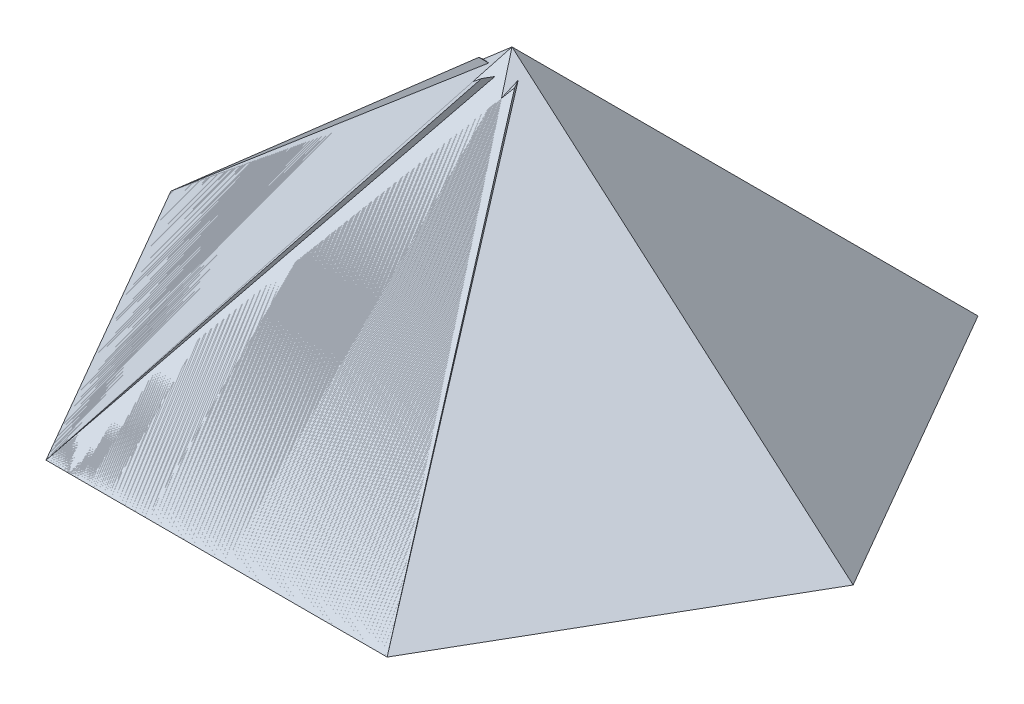
ISO-10303-21;
HEADER;
FILE_DESCRIPTION(('STEP AP214'),'2;1');
FILE_NAME('part.step','',(''),(''),'','','');
FILE_SCHEMA(('AUTOMOTIVE_DESIGN { 1 0 10303 214 1 1 1 1 }'));
ENDSEC;
DATA;
#1=APPLICATION_CONTEXT('core data for automotive mechanical design processes');
#2=APPLICATION_PROTOCOL_DEFINITION('international standard','automotive_design',2000,#1);
#3=PRODUCT_CONTEXT('',#1,'mechanical');
#4=PRODUCT('Part','Part','',(#3));
#5=PRODUCT_RELATED_PRODUCT_CATEGORY('part','',(#4));
#6=PRODUCT_DEFINITION_FORMATION('','',#4);
#7=PRODUCT_DEFINITION_CONTEXT('part definition',#1,'design');
#8=PRODUCT_DEFINITION('design','',#6,#7);
#9=PRODUCT_DEFINITION_SHAPE('','',#8);
#10=(LENGTH_UNIT() NAMED_UNIT(*) SI_UNIT(.MILLI.,.METRE.));
#11=(NAMED_UNIT(*) PLANE_ANGLE_UNIT() SI_UNIT($,.RADIAN.));
#12=(NAMED_UNIT(*) SI_UNIT($,.STERADIAN.) SOLID_ANGLE_UNIT());
#13=UNCERTAINTY_MEASURE_WITH_UNIT(LENGTH_MEASURE(1.E-05),#10,'distance_accuracy_value','');
#14=(GEOMETRIC_REPRESENTATION_CONTEXT(3) GLOBAL_UNCERTAINTY_ASSIGNED_CONTEXT((#13)) GLOBAL_UNIT_ASSIGNED_CONTEXT((#10,
#11,#12)) REPRESENTATION_CONTEXT('',''));
#15=CARTESIAN_POINT('',(0.,0.,0.));
#16=DIRECTION('',(0.,0.,1.));
#17=DIRECTION('',(1.,0.,0.));
#18=AXIS2_PLACEMENT_3D('',#15,#16,#17);
#19=CARTESIAN_POINT('',(-5.60315682740509E-13,24.3213065701559,24.3213065701559));
#20=DIRECTION('',(0.,-0.707106781186548,-0.707106781186547));
#21=DIRECTION('',(-0.377964473009212,0.654653670707977,-0.654653670707986));
#22=AXIS2_PLACEMENT_3D('',#19,#20,#21);
#23=PLANE('',#22);
#24=DIRECTION('',(-1.,0.,0.));
#25=VECTOR('',#24,1.);
#26=CARTESIAN_POINT('',(28.0838257906447,0.,48.6426131403125));
#27=LINE('',#26,#25);
#28=CARTESIAN_POINT('',(28.0838257906447,0.,48.6426131403125));
#29=VERTEX_POINT('',#28);
#30=CARTESIAN_POINT('',(-35.4161742093552,0.,48.642613140311));
#31=VERTEX_POINT('',#30);
#32=EDGE_CURVE('E93',#29,#31,#27,.T.);
#33=ORIENTED_EDGE('',*,*,#32,.T.);
#34=DIRECTION('',(0.435138197754014,0.636653260753214,-0.636653260753205));
#35=VECTOR('',#34,1.);
#36=CARTESIAN_POINT('',(0.,51.8176131403117,-3.17499999999998));
#37=LINE('',#36,#35);
#38=CARTESIAN_POINT('',(0.,51.8176131403117,-3.17499999999998));
#39=VERTEX_POINT('',#38);
#40=EDGE_CURVE('E89',#31,#39,#37,.T.);
#41=ORIENTED_EDGE('',*,*,#40,.T.);
#42=DIRECTION('',(0.357855020941318,-0.660280161744648,0.660280161744657));
#43=VECTOR('',#42,1.);
#44=CARTESIAN_POINT('',(28.0838257906447,0.,48.6426131403125));
#45=LINE('',#44,#43);
#46=EDGE_CURVE('E85',#39,#29,#45,.T.);
#47=ORIENTED_EDGE('',*,*,#46,.T.);
#48=EDGE_LOOP('',(#33,#41,#47));
#49=FACE_BOUND('',#48,.T.);
#50=ADVANCED_FACE('F52',(#49),#23,.T.);
#51=CARTESIAN_POINT('',(3.66617420935338,24.3213065701559,30.671306570156));
#52=DIRECTION('',(0.,-0.707106781186548,-0.707106781186547));
#53=DIRECTION('',(-0.377964473009212,0.654653670707977,-0.654653670707986));
#54=AXIS2_PLACEMENT_3D('',#51,#52,#53);
#55=PLANE('',#54);
#56=DIRECTION('',(-1.,0.,0.));
#57=VECTOR('',#56,1.);
#58=CARTESIAN_POINT('',(31.7499999999987,0.,54.9926131403126));
#59=LINE('',#58,#57);
#60=CARTESIAN_POINT('',(31.7499999999987,0.,54.9926131403126));
#61=VERTEX_POINT('',#60);
#62=CARTESIAN_POINT('',(-31.7500000000013,0.,54.9926131403111));
#63=VERTEX_POINT('',#62);
#64=EDGE_CURVE('E75',#61,#63,#59,.T.);
#65=ORIENTED_EDGE('',*,*,#64,.F.);
#66=DIRECTION('',(0.357855020941318,-0.660280161744648,0.660280161744657));
#67=VECTOR('',#66,1.);
#68=CARTESIAN_POINT('',(31.7499999999987,0.,54.9926131403126));
#69=LINE('',#68,#67);
#70=CARTESIAN_POINT('',(3.66617420935402,51.8176131403117,3.17500000000011));
#71=VERTEX_POINT('',#70);
#72=EDGE_CURVE('E12',#71,#61,#69,.T.);
#73=ORIENTED_EDGE('',*,*,#72,.F.);
#74=DIRECTION('',(0.435138197754014,0.636653260753214,-0.636653260753205));
#75=VECTOR('',#74,1.);
#76=CARTESIAN_POINT('',(3.66617420935402,51.8176131403117,3.17500000000011));
#77=LINE('',#76,#75);
#78=EDGE_CURVE('E66',#63,#71,#77,.T.);
#79=ORIENTED_EDGE('',*,*,#78,.F.);
#80=EDGE_LOOP('',(#65,#73,#79));
#81=FACE_BOUND('',#80,.T.);
#82=ADVANCED_FACE('F114',(#81),#55,.F.);
#83=CARTESIAN_POINT('',(28.0838257906447,0.,48.6426131403125));
#84=DIRECTION('',(0.,1.,0.));
#85=DIRECTION('',(0.86602540378445,0.,-0.49999999999998));
#86=AXIS2_PLACEMENT_3D('',#83,#84,#85);
#87=PLANE('',#86);
#88=DIRECTION('',(0.499999999999977,0.,0.866025403784452));
#89=VECTOR('',#88,1.);
#90=CARTESIAN_POINT('',(-35.4161742093552,0.,48.642613140311));
#91=LINE('',#90,#89);
#92=EDGE_CURVE('E96',#31,#63,#91,.T.);
#93=ORIENTED_EDGE('',*,*,#92,.F.);
#94=ORIENTED_EDGE('',*,*,#32,.F.);
#95=DIRECTION('',(0.499999999999977,0.,0.866025403784452));
#96=VECTOR('',#95,1.);
#97=CARTESIAN_POINT('',(28.0838257906447,0.,48.6426131403125));
#98=LINE('',#97,#96);
#99=EDGE_CURVE('E95',#29,#61,#98,.T.);
#100=ORIENTED_EDGE('',*,*,#99,.T.);
#101=ORIENTED_EDGE('',*,*,#64,.T.);
#102=EDGE_LOOP('',(#93,#94,#100,#101));
#103=FACE_BOUND('',#102,.T.);
#104=ADVANCED_FACE('F94',(#103),#87,.F.);
#105=CARTESIAN_POINT('',(0.,51.8176131403117,-3.17499999999998));
#106=DIRECTION('',(0.58490333989433,-0.737462390435805,-0.337694100737881));
#107=DIRECTION('',(-0.638661164453014,-0.675388201475794,0.368731195217888));
#108=AXIS2_PLACEMENT_3D('',#105,#106,#107);
#109=PLANE('',#108);
#110=DIRECTION('',(0.499999999999977,0.,0.866025403784452));
#111=VECTOR('',#110,1.);
#112=CARTESIAN_POINT('',(0.,51.8176131403117,-3.17499999999998));
#113=LINE('',#112,#111);
#114=EDGE_CURVE('E59',#39,#71,#113,.T.);
#115=ORIENTED_EDGE('',*,*,#114,.F.);
#116=ORIENTED_EDGE('',*,*,#40,.F.);
#117=ORIENTED_EDGE('',*,*,#92,.T.);
#118=ORIENTED_EDGE('',*,*,#78,.T.);
#119=EDGE_LOOP('',(#115,#116,#117,#118));
#120=FACE_BOUND('',#119,.T.);
#121=ADVANCED_FACE('F106',(#120),#109,.F.);
#122=CARTESIAN_POINT('',(28.0838257906447,0.,48.6426131403125));
#123=DIRECTION('',(-0.865619271316062,0.0306219338878571,0.499765519310025));
#124=DIRECTION('',(0.0265193726598922,0.999531038620096,-0.0153109669439279));
#125=AXIS2_PLACEMENT_3D('',#122,#123,#124);
#126=PLANE('',#125);
#127=ORIENTED_EDGE('',*,*,#72,.T.);
#128=ORIENTED_EDGE('',*,*,#99,.F.);
#129=ORIENTED_EDGE('',*,*,#46,.F.);
#130=ORIENTED_EDGE('',*,*,#114,.T.);
#131=EDGE_LOOP('',(#127,#128,#129,#130));
#132=FACE_BOUND('',#131,.T.);
#133=ADVANCED_FACE('F99',(#132),#126,.F.);
#134=CLOSED_SHELL('',(#50,#82,#104,#121,#133));
#135=MANIFOLD_SOLID_BREP('B2',#134);
#136=CARTESIAN_POINT('',(-21.0628693429845,24.3213065701559,12.1606532850777));
#137=DIRECTION('',(0.612372435695798,-0.707106781186548,-0.353553390593267));
#138=DIRECTION('',(0.377964473009235,0.654653670707977,-0.654653670707973));
#139=AXIS2_PLACEMENT_3D('',#136,#137,#138);
#140=PLANE('',#139);
#141=DIRECTION('',(-0.49999999999999,0.,-0.866025403784444));
#142=VECTOR('',#141,1.);
#143=CARTESIAN_POINT('',(-28.0838257906464,0.,48.6426131403115));
#144=LINE('',#143,#142);
#145=CARTESIAN_POINT('',(-28.0838257906464,0.,48.6426131403115));
#146=VERTEX_POINT('',#145);
#147=CARTESIAN_POINT('',(-59.8338257906458,0.,-6.3500000000007));
#148=VERTEX_POINT('',#147);
#149=EDGE_CURVE('E201',#146,#148,#144,.T.);
#150=ORIENTED_EDGE('',*,*,#149,.T.);
#151=DIRECTION('',(0.768926996091482,0.636653260753214,0.0585141030353414));
#152=VECTOR('',#151,1.);
#153=CARTESIAN_POINT('',(2.74963065701559,51.8176131403117,-1.58749999999995));
#154=LINE('',#153,#152);
#155=CARTESIAN_POINT('',(2.74963065701559,51.8176131403117,-1.58749999999995));
#156=VERTEX_POINT('',#155);
#157=EDGE_CURVE('E197',#148,#156,#154,.T.);
#158=ORIENTED_EDGE('',*,*,#157,.T.);
#159=DIRECTION('',(-0.392891883215105,-0.660280161744648,0.640051619879326));
#160=VECTOR('',#159,1.);
#161=CARTESIAN_POINT('',(-28.0838257906464,0.,48.6426131403115));
#162=LINE('',#161,#160);
#163=EDGE_CURVE('E193',#156,#146,#162,.T.);
#164=ORIENTED_EDGE('',*,*,#163,.T.);
#165=EDGE_LOOP('',(#150,#158,#164));
#166=FACE_BOUND('',#165,.T.);
#167=ADVANCED_FACE('F160',(#166),#140,.T.);
#168=CARTESIAN_POINT('',(-24.7290435523387,24.3213065701559,18.5106532850776));
#169=DIRECTION('',(0.612372435695798,-0.707106781186548,-0.353553390593267));
#170=DIRECTION('',(0.377964473009235,0.654653670707977,-0.654653670707973));
#171=AXIS2_PLACEMENT_3D('',#168,#169,#170);
#172=PLANE('',#171);
#173=DIRECTION('',(-0.49999999999999,0.,-0.866025403784444));
#174=VECTOR('',#173,1.);
#175=CARTESIAN_POINT('',(-31.7500000000006,0.,54.9926131403114));
#176=LINE('',#175,#174);
#177=CARTESIAN_POINT('',(-31.7500000000006,0.,54.9926131403114));
#178=VERTEX_POINT('',#177);
#179=CARTESIAN_POINT('',(-63.5,0.,-7.70217223333702E-13));
#180=VERTEX_POINT('',#179);
#181=EDGE_CURVE('E183',#178,#180,#176,.T.);
#182=ORIENTED_EDGE('',*,*,#181,.F.);
#183=DIRECTION('',(-0.392891883215105,-0.660280161744648,0.640051619879326));
#184=VECTOR('',#183,1.);
#185=CARTESIAN_POINT('',(-31.7500000000006,0.,54.9926131403114));
#186=LINE('',#185,#184);
#187=CARTESIAN_POINT('',(-0.916543552338619,51.8176131403117,4.76249999999998));
#188=VERTEX_POINT('',#187);
#189=EDGE_CURVE('E50',#188,#178,#186,.T.);
#190=ORIENTED_EDGE('',*,*,#189,.F.);
#191=DIRECTION('',(0.768926996091482,0.636653260753214,0.0585141030353414));
#192=VECTOR('',#191,1.);
#193=CARTESIAN_POINT('',(-0.916543552338619,51.8176131403117,4.76249999999998));
#194=LINE('',#193,#192);
#195=EDGE_CURVE('E174',#180,#188,#194,.T.);
#196=ORIENTED_EDGE('',*,*,#195,.F.);
#197=EDGE_LOOP('',(#182,#190,#196));
#198=FACE_BOUND('',#197,.T.);
#199=ADVANCED_FACE('F222',(#198),#172,.F.);
#200=CARTESIAN_POINT('',(-28.0838257906464,0.,48.6426131403115));
#201=DIRECTION('',(0.,1.,0.));
#202=DIRECTION('',(0.866025403784433,0.,0.50000000000001));
#203=AXIS2_PLACEMENT_3D('',#200,#201,#202);
#204=PLANE('',#203);
#205=DIRECTION('',(-0.500000000000013,0.,0.866025403784431));
#206=VECTOR('',#205,1.);
#207=CARTESIAN_POINT('',(-59.8338257906458,0.,-6.3500000000007));
#208=LINE('',#207,#206);
#209=EDGE_CURVE('E204',#148,#180,#208,.T.);
#210=ORIENTED_EDGE('',*,*,#209,.F.);
#211=ORIENTED_EDGE('',*,*,#149,.F.);
#212=DIRECTION('',(-0.500000000000013,0.,0.866025403784431));
#213=VECTOR('',#212,1.);
#214=CARTESIAN_POINT('',(-28.0838257906464,0.,48.6426131403115));
#215=LINE('',#214,#213);
#216=EDGE_CURVE('E203',#146,#178,#215,.T.);
#217=ORIENTED_EDGE('',*,*,#216,.T.);
#218=ORIENTED_EDGE('',*,*,#181,.T.);
#219=EDGE_LOOP('',(#210,#211,#217,#218));
#220=FACE_BOUND('',#219,.T.);
#221=ADVANCED_FACE('F202',(#220),#204,.F.);
#222=CARTESIAN_POINT('',(2.74963065701559,51.8176131403117,-1.58749999999995));
#223=DIRECTION('',(0.584903339894315,-0.737462390435805,0.337694100737906));
#224=DIRECTION('',(-0.638661164453001,-0.675388201475794,-0.36873119521791));
#225=AXIS2_PLACEMENT_3D('',#222,#223,#224);
#226=PLANE('',#225);
#227=DIRECTION('',(-0.500000000000013,0.,0.866025403784431));
#228=VECTOR('',#227,1.);
#229=CARTESIAN_POINT('',(2.74963065701559,51.8176131403117,-1.58749999999995));
#230=LINE('',#229,#228);
#231=EDGE_CURVE('E167',#156,#188,#230,.T.);
#232=ORIENTED_EDGE('',*,*,#231,.F.);
#233=ORIENTED_EDGE('',*,*,#157,.F.);
#234=ORIENTED_EDGE('',*,*,#209,.T.);
#235=ORIENTED_EDGE('',*,*,#195,.T.);
#236=EDGE_LOOP('',(#232,#233,#234,#235));
#237=FACE_BOUND('',#236,.T.);
#238=ADVANCED_FACE('F214',(#237),#226,.F.);
#239=CARTESIAN_POINT('',(-28.0838257906464,0.,48.6426131403115));
#240=DIRECTION('',(-0.86561927131604,0.0306219338878571,-0.499765519310061));
#241=DIRECTION('',(0.0265193726598917,0.999531038620096,0.0153109669439289));
#242=AXIS2_PLACEMENT_3D('',#239,#240,#241);
#243=PLANE('',#242);
#244=ORIENTED_EDGE('',*,*,#189,.T.);
#245=ORIENTED_EDGE('',*,*,#216,.F.);
#246=ORIENTED_EDGE('',*,*,#163,.F.);
#247=ORIENTED_EDGE('',*,*,#231,.T.);
#248=EDGE_LOOP('',(#244,#245,#246,#247));
#249=FACE_BOUND('',#248,.T.);
#250=ADVANCED_FACE('F207',(#249),#243,.F.);
#251=CLOSED_SHELL('',(#167,#199,#221,#238,#250));
#252=MANIFOLD_SOLID_BREP('B6',#251);
#253=CARTESIAN_POINT('',(-21.0628693429844,24.3213065701559,-12.1606532850779));
#254=DIRECTION('',(0.612372435695794,-0.707106781186548,0.353553390593274));
#255=DIRECTION('',(0.755928946018455,0.654653670707977,0.));
#256=AXIS2_PLACEMENT_3D('',#253,#254,#255);
#257=PLANE('',#256);
#258=DIRECTION('',(0.5,0.,-0.866025403784439));
#259=VECTOR('',#258,1.);
#260=CARTESIAN_POINT('',(-56.1676515812917,0.,0.));
#261=LINE('',#260,#259);
#262=CARTESIAN_POINT('',(-56.1676515812917,0.,0.));
#263=VERTEX_POINT('',#262);
#264=CARTESIAN_POINT('',(-24.4176515812917,0.,-54.9926131403118));
#265=VERTEX_POINT('',#264);
#266=EDGE_CURVE('E309',#263,#265,#261,.T.);
#267=ORIENTED_EDGE('',*,*,#266,.T.);
#268=DIRECTION('',(0.333788798337483,0.636653260753214,0.695167363788547));
#269=VECTOR('',#268,1.);
#270=CARTESIAN_POINT('',(2.74963065701557,51.8176131403117,1.58749999999999));
#271=LINE('',#270,#269);
#272=CARTESIAN_POINT('',(2.74963065701557,51.8176131403117,1.58749999999999));
#273=VERTEX_POINT('',#272);
#274=EDGE_CURVE('E305',#265,#273,#271,.T.);
#275=ORIENTED_EDGE('',*,*,#274,.T.);
#276=DIRECTION('',(-0.75074690415643,-0.660280161744648,-0.0202285418653177));
#277=VECTOR('',#276,1.);
#278=CARTESIAN_POINT('',(-56.1676515812917,0.,0.));
#279=LINE('',#278,#277);
#280=EDGE_CURVE('E301',#273,#263,#279,.T.);
#281=ORIENTED_EDGE('',*,*,#280,.T.);
#282=EDGE_LOOP('',(#267,#275,#281));
#283=FACE_BOUND('',#282,.T.);
#284=ADVANCED_FACE('F267',(#283),#257,.T.);
#285=CARTESIAN_POINT('',(-28.3952177616926,24.3213065701559,-12.160653285078));
#286=DIRECTION('',(0.612372435695794,-0.707106781186548,0.353553390593274));
#287=DIRECTION('',(0.755928946018455,0.654653670707977,0.));
#288=AXIS2_PLACEMENT_3D('',#285,#286,#287);
#289=PLANE('',#288);
#290=DIRECTION('',(0.5,0.,-0.866025403784439));
#291=VECTOR('',#290,1.);
#292=CARTESIAN_POINT('',(-63.4999999999999,0.,0.));
#293=LINE('',#292,#291);
#294=CARTESIAN_POINT('',(-63.4999999999999,0.,0.));
#295=VERTEX_POINT('',#294);
#296=CARTESIAN_POINT('',(-31.75,0.,-54.9926131403119));
#297=VERTEX_POINT('',#296);
#298=EDGE_CURVE('E291',#295,#297,#293,.T.);
#299=ORIENTED_EDGE('',*,*,#298,.F.);
#300=DIRECTION('',(-0.75074690415643,-0.660280161744648,-0.0202285418653177));
#301=VECTOR('',#300,1.);
#302=CARTESIAN_POINT('',(-63.4999999999999,0.,0.));
#303=LINE('',#302,#301);
#304=CARTESIAN_POINT('',(-4.58271776169266,51.8176131403117,1.58749999999997));
#305=VERTEX_POINT('',#304);
#306=EDGE_CURVE('E158',#305,#295,#303,.T.);
#307=ORIENTED_EDGE('',*,*,#306,.F.);
#308=DIRECTION('',(0.333788798337483,0.636653260753214,0.695167363788547));
#309=VECTOR('',#308,1.);
#310=CARTESIAN_POINT('',(-4.58271776169266,51.8176131403117,1.58749999999997));
#311=LINE('',#310,#309);
#312=EDGE_CURVE('E282',#297,#305,#311,.T.);
#313=ORIENTED_EDGE('',*,*,#312,.F.);
#314=EDGE_LOOP('',(#299,#307,#313));
#315=FACE_BOUND('',#314,.T.);
#316=ADVANCED_FACE('F337',(#315),#289,.F.);
#317=CARTESIAN_POINT('',(-56.1676515812917,0.,0.));
#318=DIRECTION('',(0.,1.,0.));
#319=DIRECTION('',(0.,0.,1.));
#320=AXIS2_PLACEMENT_3D('',#317,#318,#319);
#321=PLANE('',#320);
#322=DIRECTION('',(-1.,0.,0.));
#323=VECTOR('',#322,1.);
#324=CARTESIAN_POINT('',(-24.4176515812917,0.,-54.9926131403118));
#325=LINE('',#324,#323);
#326=EDGE_CURVE('E312',#265,#297,#325,.T.);
#327=ORIENTED_EDGE('',*,*,#326,.F.);
#328=ORIENTED_EDGE('',*,*,#266,.F.);
#329=DIRECTION('',(-1.,0.,0.));
#330=VECTOR('',#329,1.);
#331=CARTESIAN_POINT('',(-56.1676515812917,0.,0.));
#332=LINE('',#331,#330);
#333=EDGE_CURVE('E311',#263,#295,#332,.T.);
#334=ORIENTED_EDGE('',*,*,#333,.T.);
#335=ORIENTED_EDGE('',*,*,#298,.T.);
#336=EDGE_LOOP('',(#327,#328,#334,#335));
#337=FACE_BOUND('',#336,.T.);
#338=ADVANCED_FACE('F310',(#337),#321,.F.);
#339=CARTESIAN_POINT('',(2.74963065701557,51.8176131403117,1.58749999999999));
#340=DIRECTION('',(0.,-0.737462390435805,0.675388201475794));
#341=DIRECTION('',(0.,-0.675388201475794,-0.737462390435805));
#342=AXIS2_PLACEMENT_3D('',#339,#340,#341);
#343=PLANE('',#342);
#344=DIRECTION('',(-1.,0.,0.));
#345=VECTOR('',#344,1.);
#346=CARTESIAN_POINT('',(2.74963065701557,51.8176131403117,1.58749999999999));
#347=LINE('',#346,#345);
#348=EDGE_CURVE('E275',#273,#305,#347,.T.);
#349=ORIENTED_EDGE('',*,*,#348,.F.);
#350=ORIENTED_EDGE('',*,*,#274,.F.);
#351=ORIENTED_EDGE('',*,*,#326,.T.);
#352=ORIENTED_EDGE('',*,*,#312,.T.);
#353=EDGE_LOOP('',(#349,#350,#351,#352));
#354=FACE_BOUND('',#353,.T.);
#355=ADVANCED_FACE('F329',(#354),#343,.F.);
#356=CARTESIAN_POINT('',(-56.1676515812917,0.,0.));
#357=DIRECTION('',(0.,0.0306219338878571,-0.999531038620096));
#358=DIRECTION('',(0.,0.999531038620096,0.0306219338878571));
#359=AXIS2_PLACEMENT_3D('',#356,#357,#358);
#360=PLANE('',#359);
#361=ORIENTED_EDGE('',*,*,#306,.T.);
#362=ORIENTED_EDGE('',*,*,#333,.F.);
#363=ORIENTED_EDGE('',*,*,#280,.F.);
#364=ORIENTED_EDGE('',*,*,#348,.T.);
#365=EDGE_LOOP('',(#361,#362,#363,#364));
#366=FACE_BOUND('',#365,.T.);
#367=ADVANCED_FACE('F317',(#366),#360,.F.);
#368=CLOSED_SHELL('',(#284,#316,#338,#355,#367));
#369=MANIFOLD_SOLID_BREP('B44',#368);
#370=CARTESIAN_POINT('',(0.,0.,0.));
#371=DIRECTION('',(0.,1.,0.));
#372=DIRECTION('',(0.,0.,1.));
#373=AXIS2_PLACEMENT_3D('',#370,#371,#372);
#374=PLANE('',#373);
#375=DIRECTION('',(-1.,0.,0.));
#376=VECTOR('',#375,1.);
#377=CARTESIAN_POINT('',(31.75,0.,-54.9926131403118));
#378=LINE('',#377,#376);
#379=CARTESIAN_POINT('',(31.75,0.,-54.9926131403118));
#380=VERTEX_POINT('',#379);
#381=CARTESIAN_POINT('',(-31.75,0.,-54.9926131403118));
#382=VERTEX_POINT('',#381);
#383=EDGE_CURVE('E465',#380,#382,#378,.T.);
#384=ORIENTED_EDGE('',*,*,#383,.F.);
#385=DIRECTION('',(-0.5,0.,-0.866025403784439));
#386=VECTOR('',#385,1.);
#387=CARTESIAN_POINT('',(63.5,0.,0.));
#388=LINE('',#387,#386);
#389=CARTESIAN_POINT('',(63.5,0.,0.));
#390=VERTEX_POINT('',#389);
#391=EDGE_CURVE('E485',#390,#380,#388,.T.);
#392=ORIENTED_EDGE('',*,*,#391,.F.);
#393=DIRECTION('',(0.5,0.,-0.866025403784439));
#394=VECTOR('',#393,1.);
#395=CARTESIAN_POINT('',(31.75,0.,54.9926131403118));
#396=LINE('',#395,#394);
#397=CARTESIAN_POINT('',(31.75,0.,54.9926131403118));
#398=VERTEX_POINT('',#397);
#399=EDGE_CURVE('E482',#398,#390,#396,.T.);
#400=ORIENTED_EDGE('',*,*,#399,.F.);
#401=DIRECTION('',(1.,0.,0.));
#402=VECTOR('',#401,1.);
#403=CARTESIAN_POINT('',(-31.75,0.,54.9926131403118));
#404=LINE('',#403,#402);
#405=CARTESIAN_POINT('',(-31.75,0.,54.9926131403118));
#406=VERTEX_POINT('',#405);
#407=EDGE_CURVE('E479',#406,#398,#404,.T.);
#408=ORIENTED_EDGE('',*,*,#407,.F.);
#409=DIRECTION('',(0.5,0.,0.866025403784439));
#410=VECTOR('',#409,1.);
#411=CARTESIAN_POINT('',(-63.5,0.,0.));
#412=LINE('',#411,#410);
#413=CARTESIAN_POINT('',(-63.5,0.,0.));
#414=VERTEX_POINT('',#413);
#415=EDGE_CURVE('E476',#414,#406,#412,.T.);
#416=ORIENTED_EDGE('',*,*,#415,.F.);
#417=DIRECTION('',(-0.5,0.,0.866025403784439));
#418=VECTOR('',#417,1.);
#419=CARTESIAN_POINT('',(-31.75,0.,-54.9926131403118));
#420=LINE('',#419,#418);
#421=EDGE_CURVE('E474',#382,#414,#420,.T.);
#422=ORIENTED_EDGE('',*,*,#421,.F.);
#423=EDGE_LOOP('',(#384,#392,#400,#408,#416,#422));
#424=FACE_BOUND('',#423,.T.);
#425=DIRECTION('',(-0.5,0.,0.866025403784439));
#426=VECTOR('',#425,1.);
#427=CARTESIAN_POINT('',(-42.1257386859688,0.,-24.3213065701559));
#428=LINE('',#427,#426);
#429=CARTESIAN_POINT('',(-28.0838257906459,0.,-48.6426131403118));
#430=VERTEX_POINT('',#429);
#431=CARTESIAN_POINT('',(-56.1676515812917,0.,0.));
#432=VERTEX_POINT('',#431);
#433=EDGE_CURVE('E390',#430,#432,#428,.T.);
#434=ORIENTED_EDGE('',*,*,#433,.T.);
#435=DIRECTION('',(0.5,0.,0.866025403784439));
#436=VECTOR('',#435,1.);
#437=CARTESIAN_POINT('',(-42.1257386859688,0.,24.3213065701559));
#438=LINE('',#437,#436);
#439=CARTESIAN_POINT('',(-28.0838257906459,0.,48.6426131403118));
#440=VERTEX_POINT('',#439);
#441=EDGE_CURVE('E460',#432,#440,#438,.T.);
#442=ORIENTED_EDGE('',*,*,#441,.T.);
#443=DIRECTION('',(1.,0.,0.));
#444=VECTOR('',#443,1.);
#445=CARTESIAN_POINT('',(0.,0.,48.6426131403118));
#446=LINE('',#445,#444);
#447=CARTESIAN_POINT('',(28.0838257906459,0.,48.6426131403118));
#448=VERTEX_POINT('',#447);
#449=EDGE_CURVE('E455',#440,#448,#446,.T.);
#450=ORIENTED_EDGE('',*,*,#449,.T.);
#451=DIRECTION('',(0.5,0.,-0.866025403784439));
#452=VECTOR('',#451,1.);
#453=CARTESIAN_POINT('',(42.1257386859688,0.,24.3213065701559));
#454=LINE('',#453,#452);
#455=CARTESIAN_POINT('',(56.1676515812918,0.,0.));
#456=VERTEX_POINT('',#455);
#457=EDGE_CURVE('E453',#448,#456,#454,.T.);
#458=ORIENTED_EDGE('',*,*,#457,.T.);
#459=DIRECTION('',(-0.5,0.,-0.866025403784439));
#460=VECTOR('',#459,1.);
#461=CARTESIAN_POINT('',(42.1257386859688,0.,-24.3213065701559));
#462=LINE('',#461,#460);
#463=CARTESIAN_POINT('',(28.0838257906459,0.,-48.6426131403118));
#464=VERTEX_POINT('',#463);
#465=EDGE_CURVE('E440',#456,#464,#462,.T.);
#466=ORIENTED_EDGE('',*,*,#465,.T.);
#467=DIRECTION('',(-1.,0.,0.));
#468=VECTOR('',#467,1.);
#469=CARTESIAN_POINT('',(0.,0.,-48.6426131403118));
#470=LINE('',#469,#468);
#471=EDGE_CURVE('E447',#464,#430,#470,.T.);
#472=ORIENTED_EDGE('',*,*,#471,.T.);
#473=EDGE_LOOP('',(#434,#442,#450,#458,#466,#472));
#474=FACE_BOUND('',#473,.T.);
#475=ADVANCED_FACE('F374',(#424,#474),#374,.F.);
#476=CARTESIAN_POINT('',(31.75,0.,-54.9926131403118));
#477=DIRECTION('',(0.,0.707106781186548,-0.707106781186547));
#478=DIRECTION('',(0.,0.707106781186547,0.707106781186548));
#479=AXIS2_PLACEMENT_3D('',#476,#477,#478);
#480=PLANE('',#479);
#481=ORIENTED_EDGE('',*,*,#383,.T.);
#482=DIRECTION('',(-0.377964473009227,-0.654653670707976,-0.654653670707978));
#483=VECTOR('',#482,1.);
#484=CARTESIAN_POINT('',(-31.75,0.,-54.9926131403118));
#485=LINE('',#484,#483);
#486=CARTESIAN_POINT('',(0.,54.9926131403117,0.));
#487=VERTEX_POINT('',#486);
#488=EDGE_CURVE('E265',#487,#382,#485,.T.);
#489=ORIENTED_EDGE('',*,*,#488,.F.);
#490=DIRECTION('',(0.377964473009227,-0.654653670707977,-0.654653670707978));
#491=VECTOR('',#490,1.);
#492=CARTESIAN_POINT('',(31.75,0.,-54.9926131403118));
#493=LINE('',#492,#491);
#494=EDGE_CURVE('E487',#487,#380,#493,.T.);
#495=ORIENTED_EDGE('',*,*,#494,.T.);
#496=EDGE_LOOP('',(#481,#489,#495));
#497=FACE_BOUND('',#496,.T.);
#498=ADVANCED_FACE('F513',(#497),#480,.T.);
#499=CARTESIAN_POINT('',(-31.75,0.,-54.9926131403118));
#500=DIRECTION('',(-0.612372435695794,0.707106781186548,-0.353553390593273));
#501=DIRECTION('',(-0.755928946018455,-0.654653670707977,0.));
#502=AXIS2_PLACEMENT_3D('',#499,#500,#501);
#503=PLANE('',#502);
#504=ORIENTED_EDGE('',*,*,#421,.T.);
#505=DIRECTION('',(-0.755928946018455,-0.654653670707977,0.));
#506=VECTOR('',#505,1.);
#507=CARTESIAN_POINT('',(-63.5,0.,0.));
#508=LINE('',#507,#506);
#509=EDGE_CURVE('E378',#487,#414,#508,.T.);
#510=ORIENTED_EDGE('',*,*,#509,.F.);
#511=ORIENTED_EDGE('',*,*,#488,.T.);
#512=EDGE_LOOP('',(#504,#510,#511));
#513=FACE_BOUND('',#512,.T.);
#514=ADVANCED_FACE('F376',(#513),#503,.T.);
#515=CARTESIAN_POINT('',(-63.5,0.,0.));
#516=DIRECTION('',(-0.612372435695794,0.707106781186548,0.353553390593273));
#517=DIRECTION('',(-0.755928946018455,-0.654653670707976,0.));
#518=AXIS2_PLACEMENT_3D('',#515,#516,#517);
#519=PLANE('',#518);
#520=ORIENTED_EDGE('',*,*,#415,.T.);
#521=DIRECTION('',(-0.377964473009228,-0.654653670707976,0.654653670707978));
#522=VECTOR('',#521,1.);
#523=CARTESIAN_POINT('',(-31.75,0.,54.9926131403118));
#524=LINE('',#523,#522);
#525=EDGE_CURVE('E493',#487,#406,#524,.T.);
#526=ORIENTED_EDGE('',*,*,#525,.F.);
#527=ORIENTED_EDGE('',*,*,#509,.T.);
#528=EDGE_LOOP('',(#520,#526,#527));
#529=FACE_BOUND('',#528,.T.);
#530=ADVANCED_FACE('F497',(#529),#519,.T.);
#531=CARTESIAN_POINT('',(-31.75,0.,54.9926131403118));
#532=DIRECTION('',(0.,0.707106781186548,0.707106781186547));
#533=DIRECTION('',(0.,-0.707106781186547,0.707106781186548));
#534=AXIS2_PLACEMENT_3D('',#531,#532,#533);
#535=PLANE('',#534);
#536=ORIENTED_EDGE('',*,*,#407,.T.);
#537=DIRECTION('',(0.377964473009227,-0.654653670707977,0.654653670707978));
#538=VECTOR('',#537,1.);
#539=CARTESIAN_POINT('',(31.75,0.,54.9926131403118));
#540=LINE('',#539,#538);
#541=EDGE_CURVE('E492',#487,#398,#540,.T.);
#542=ORIENTED_EDGE('',*,*,#541,.F.);
#543=ORIENTED_EDGE('',*,*,#525,.T.);
#544=EDGE_LOOP('',(#536,#542,#543));
#545=FACE_BOUND('',#544,.T.);
#546=ADVANCED_FACE('F505',(#545),#535,.T.);
#547=CARTESIAN_POINT('',(31.75,0.,54.9926131403118));
#548=DIRECTION('',(0.612372435695794,0.707106781186548,0.353553390593273));
#549=DIRECTION('',(-0.755928946018455,0.654653670707977,0.));
#550=AXIS2_PLACEMENT_3D('',#547,#548,#549);
#551=PLANE('',#550);
#552=ORIENTED_EDGE('',*,*,#399,.T.);
#553=DIRECTION('',(0.755928946018455,-0.654653670707976,0.));
#554=VECTOR('',#553,1.);
#555=CARTESIAN_POINT('',(63.5,0.,0.));
#556=LINE('',#555,#554);
#557=EDGE_CURVE('E490',#487,#390,#556,.T.);
#558=ORIENTED_EDGE('',*,*,#557,.F.);
#559=ORIENTED_EDGE('',*,*,#541,.T.);
#560=EDGE_LOOP('',(#552,#558,#559));
#561=FACE_BOUND('',#560,.T.);
#562=ADVANCED_FACE('F509',(#561),#551,.T.);
#563=CARTESIAN_POINT('',(63.5,0.,0.));
#564=DIRECTION('',(0.612372435695794,0.707106781186548,-0.353553390593273));
#565=DIRECTION('',(-0.755928946018455,0.654653670707976,0.));
#566=AXIS2_PLACEMENT_3D('',#563,#564,#565);
#567=PLANE('',#566);
#568=ORIENTED_EDGE('',*,*,#391,.T.);
#569=ORIENTED_EDGE('',*,*,#494,.F.);
#570=ORIENTED_EDGE('',*,*,#557,.T.);
#571=EDGE_LOOP('',(#568,#569,#570));
#572=FACE_BOUND('',#571,.T.);
#573=ADVANCED_FACE('F511',(#572),#567,.T.);
#574=CARTESIAN_POINT('',(-42.1257386859688,0.,-24.3213065701559));
#575=DIRECTION('',(-0.612372435695794,0.707106781186548,-0.353553390593273));
#576=DIRECTION('',(-0.755928946018455,-0.654653670707977,0.));
#577=AXIS2_PLACEMENT_3D('',#574,#575,#576);
#578=PLANE('',#577);
#579=ORIENTED_EDGE('',*,*,#433,.F.);
#580=DIRECTION('',(-0.377964473009227,-0.654653670707977,-0.654653670707978));
#581=VECTOR('',#580,1.);
#582=CARTESIAN_POINT('',(-24.0718506776964,6.94894473433026,-41.6936684059816));
#583=LINE('',#582,#581);
#584=CARTESIAN_POINT('',(0.,48.6426131403118,0.));
#585=VERTEX_POINT('',#584);
#586=EDGE_CURVE('E444',#585,#430,#583,.T.);
#587=ORIENTED_EDGE('',*,*,#586,.F.);
#588=DIRECTION('',(-0.755928946018455,-0.654653670707977,0.));
#589=VECTOR('',#588,1.);
#590=CARTESIAN_POINT('',(-48.1437013553929,6.94894473433026,0.));
#591=LINE('',#590,#589);
#592=EDGE_CURVE('E463',#585,#432,#591,.T.);
#593=ORIENTED_EDGE('',*,*,#592,.T.);
#594=EDGE_LOOP('',(#579,#587,#593));
#595=FACE_BOUND('',#594,.T.);
#596=ADVANCED_FACE('F525',(#595),#578,.F.);
#597=CARTESIAN_POINT('',(-42.1257386859688,0.,24.3213065701559));
#598=DIRECTION('',(-0.612372435695794,0.707106781186548,0.353553390593273));
#599=DIRECTION('',(-0.755928946018455,-0.654653670707977,0.));
#600=AXIS2_PLACEMENT_3D('',#597,#598,#599);
#601=PLANE('',#600);
#602=ORIENTED_EDGE('',*,*,#441,.F.);
#603=ORIENTED_EDGE('',*,*,#592,.F.);
#604=DIRECTION('',(-0.377964473009227,-0.654653670707977,0.654653670707978));
#605=VECTOR('',#604,1.);
#606=CARTESIAN_POINT('',(-24.0718506776964,6.94894473433026,41.6936684059816));
#607=LINE('',#606,#605);
#608=EDGE_CURVE('E466',#585,#440,#607,.T.);
#609=ORIENTED_EDGE('',*,*,#608,.T.);
#610=EDGE_LOOP('',(#602,#603,#609));
#611=FACE_BOUND('',#610,.T.);
#612=ADVANCED_FACE('F553',(#611),#601,.F.);
#613=CARTESIAN_POINT('',(0.,0.,48.6426131403118));
#614=DIRECTION('',(0.,0.707106781186548,0.707106781186547));
#615=DIRECTION('',(0.,-0.707106781186547,0.707106781186548));
#616=AXIS2_PLACEMENT_3D('',#613,#614,#615);
#617=PLANE('',#616);
#618=ORIENTED_EDGE('',*,*,#449,.F.);
#619=ORIENTED_EDGE('',*,*,#608,.F.);
#620=DIRECTION('',(0.377964473009227,-0.654653670707977,0.654653670707978));
#621=VECTOR('',#620,1.);
#622=CARTESIAN_POINT('',(24.0718506776965,6.94894473433026,41.6936684059816));
#623=LINE('',#622,#621);
#624=EDGE_CURVE('E469',#585,#448,#623,.T.);
#625=ORIENTED_EDGE('',*,*,#624,.T.);
#626=EDGE_LOOP('',(#618,#619,#625));
#627=FACE_BOUND('',#626,.T.);
#628=ADVANCED_FACE('F560',(#627),#617,.F.);
#629=CARTESIAN_POINT('',(42.1257386859688,0.,24.3213065701559));
#630=DIRECTION('',(0.612372435695794,0.707106781186548,0.353553390593273));
#631=DIRECTION('',(-0.755928946018455,0.654653670707977,0.));
#632=AXIS2_PLACEMENT_3D('',#629,#630,#631);
#633=PLANE('',#632);
#634=ORIENTED_EDGE('',*,*,#457,.F.);
#635=ORIENTED_EDGE('',*,*,#624,.F.);
#636=DIRECTION('',(0.755928946018455,-0.654653670707977,0.));
#637=VECTOR('',#636,1.);
#638=CARTESIAN_POINT('',(48.1437013553929,6.94894473433027,0.));
#639=LINE('',#638,#637);
#640=EDGE_CURVE('E442',#585,#456,#639,.T.);
#641=ORIENTED_EDGE('',*,*,#640,.T.);
#642=EDGE_LOOP('',(#634,#635,#641));
#643=FACE_BOUND('',#642,.T.);
#644=ADVANCED_FACE('F567',(#643),#633,.F.);
#645=CARTESIAN_POINT('',(42.1257386859688,0.,-24.3213065701559));
#646=DIRECTION('',(0.612372435695794,0.707106781186548,-0.353553390593274));
#647=DIRECTION('',(-0.755928946018455,0.654653670707977,0.));
#648=AXIS2_PLACEMENT_3D('',#645,#646,#647);
#649=PLANE('',#648);
#650=ORIENTED_EDGE('',*,*,#465,.F.);
#651=ORIENTED_EDGE('',*,*,#640,.F.);
#652=DIRECTION('',(0.377964473009227,-0.654653670707977,-0.654653670707978));
#653=VECTOR('',#652,1.);
#654=CARTESIAN_POINT('',(24.0718506776964,6.94894473433026,-41.6936684059816));
#655=LINE('',#654,#653);
#656=EDGE_CURVE('E436',#585,#464,#655,.T.);
#657=ORIENTED_EDGE('',*,*,#656,.T.);
#658=EDGE_LOOP('',(#650,#651,#657));
#659=FACE_BOUND('',#658,.T.);
#660=ADVANCED_FACE('F438',(#659),#649,.F.);
#661=CARTESIAN_POINT('',(0.,0.,-48.6426131403118));
#662=DIRECTION('',(0.,0.707106781186548,-0.707106781186547));
#663=DIRECTION('',(0.,0.707106781186547,0.707106781186548));
#664=AXIS2_PLACEMENT_3D('',#661,#662,#663);
#665=PLANE('',#664);
#666=ORIENTED_EDGE('',*,*,#471,.F.);
#667=ORIENTED_EDGE('',*,*,#656,.F.);
#668=ORIENTED_EDGE('',*,*,#586,.T.);
#669=EDGE_LOOP('',(#666,#667,#668));
#670=FACE_BOUND('',#669,.T.);
#671=ADVANCED_FACE('F448',(#670),#665,.F.);
#672=CLOSED_SHELL('',(#475,#498,#514,#530,#546,#562,#573,#596,#612,#628,#644,#660,#671));
#673=MANIFOLD_SOLID_BREP('B152_NOT_SHOWN',#672);
#674=ADVANCED_BREP_SHAPE_REPRESENTATION('',(#18,#135,#252,#369,#673),#14);
#675=SHAPE_DEFINITION_REPRESENTATION(#9,#674);
ENDSEC;
END-ISO-10303-21;
